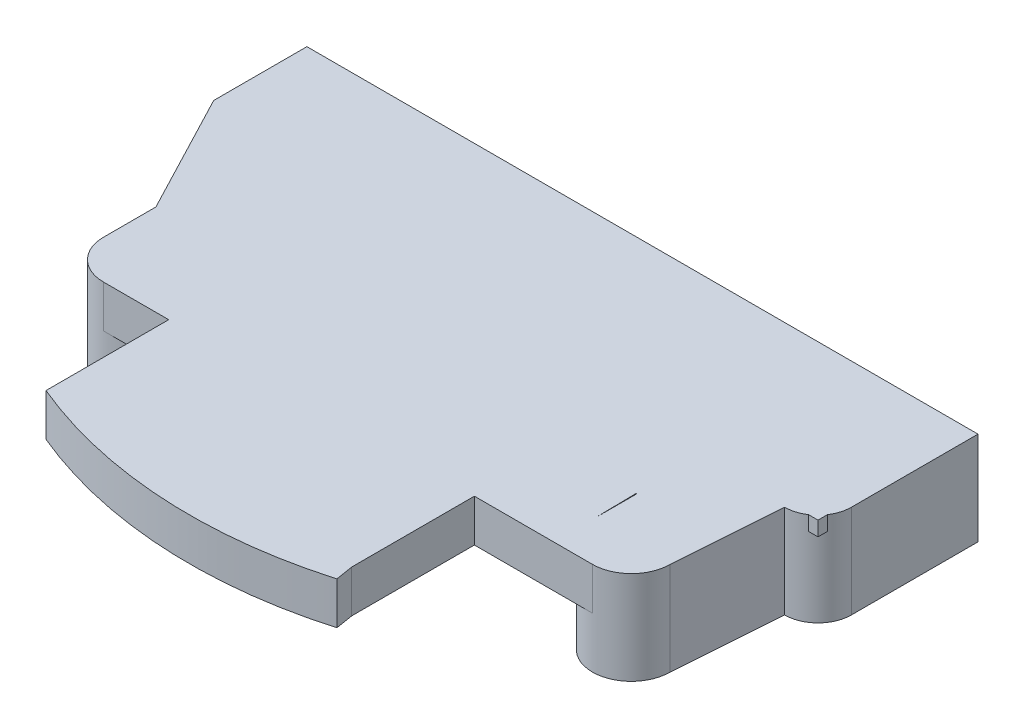
ISO-10303-21;
HEADER;
FILE_DESCRIPTION(('STEP AP214'),'2;1');
FILE_NAME('part.step','',(''),(''),'','','');
FILE_SCHEMA(('AUTOMOTIVE_DESIGN { 1 0 10303 214 1 1 1 1 }'));
ENDSEC;
DATA;
#1=APPLICATION_CONTEXT('core data for automotive mechanical design processes');
#2=APPLICATION_PROTOCOL_DEFINITION('international standard','automotive_design',2000,#1);
#3=PRODUCT_CONTEXT('',#1,'mechanical');
#4=PRODUCT('Part','Part','',(#3));
#5=PRODUCT_RELATED_PRODUCT_CATEGORY('part','',(#4));
#6=PRODUCT_DEFINITION_FORMATION('','',#4);
#7=PRODUCT_DEFINITION_CONTEXT('part definition',#1,'design');
#8=PRODUCT_DEFINITION('design','',#6,#7);
#9=PRODUCT_DEFINITION_SHAPE('','',#8);
#10=(LENGTH_UNIT() NAMED_UNIT(*) SI_UNIT(.MILLI.,.METRE.));
#11=(NAMED_UNIT(*) PLANE_ANGLE_UNIT() SI_UNIT($,.RADIAN.));
#12=(NAMED_UNIT(*) SI_UNIT($,.STERADIAN.) SOLID_ANGLE_UNIT());
#13=UNCERTAINTY_MEASURE_WITH_UNIT(LENGTH_MEASURE(1.E-05),#10,'distance_accuracy_value','');
#14=(GEOMETRIC_REPRESENTATION_CONTEXT(3) GLOBAL_UNCERTAINTY_ASSIGNED_CONTEXT((#13)) GLOBAL_UNIT_ASSIGNED_CONTEXT((#10,
#11,#12)) REPRESENTATION_CONTEXT('',''));
#15=CARTESIAN_POINT('',(0.,0.,0.));
#16=DIRECTION('',(0.,0.,1.));
#17=DIRECTION('',(1.,0.,0.));
#18=AXIS2_PLACEMENT_3D('',#15,#16,#17);
#19=CARTESIAN_POINT('',(-58.3130040874103,-46.5902974390858,26.1374810721039));
#20=DIRECTION('',(0.,1.,0.));
#21=DIRECTION('',(0.,0.,1.));
#22=AXIS2_PLACEMENT_3D('',#19,#20,#21);
#23=PLANE('',#22);
#24=CARTESIAN_POINT('',(36.5854661779904,-46.5902974390858,-15.2745439278961));
#25=DIRECTION('',(0.,1.,0.));
#26=DIRECTION('',(0.,0.,1.));
#27=AXIS2_PLACEMENT_3D('',#24,#25,#26);
#28=CIRCLE('',#27,3.81);
#29=CARTESIAN_POINT('',(36.5854661779904,-46.5902974390858,-11.4645439278961));
#30=VERTEX_POINT('',#29);
#31=CARTESIAN_POINT('',(40.3954661779904,-46.5902974390858,-15.2745439278961));
#32=VERTEX_POINT('',#31);
#33=EDGE_CURVE('E317',#30,#32,#28,.T.);
#34=ORIENTED_EDGE('',*,*,#33,.F.);
#35=DIRECTION('',(-0.0727235930973166,0.,0.997352133906082));
#36=VECTOR('',#35,1.);
#37=CARTESIAN_POINT('',(35.6964661779905,-46.5902974390858,0.727456072103921));
#38=LINE('',#37,#36);
#39=CARTESIAN_POINT('',(35.6964661779905,-46.5902974390858,0.727456072103921));
#40=VERTEX_POINT('',#39);
#41=EDGE_CURVE('E330',#30,#40,#38,.T.);
#42=ORIENTED_EDGE('',*,*,#41,.T.);
#43=CARTESIAN_POINT('',(31.2514661779905,-46.5902974390858,0.727456072103914));
#44=DIRECTION('',(0.,1.,0.));
#45=DIRECTION('',(0.,0.,1.));
#46=AXIS2_PLACEMENT_3D('',#43,#44,#45);
#47=CIRCLE('',#46,4.445);
#48=CARTESIAN_POINT('',(26.8064661779905,-46.5902974390858,0.727456072103914));
#49=VERTEX_POINT('',#48);
#50=EDGE_CURVE('E326',#40,#49,#47,.F.);
#51=ORIENTED_EDGE('',*,*,#50,.T.);
#52=DIRECTION('',(0.,0.,-1.));
#53=VECTOR('',#52,1.);
#54=CARTESIAN_POINT('',(26.8064661779905,-46.5902974390858,0.727456072103914));
#55=LINE('',#54,#53);
#56=CARTESIAN_POINT('',(26.8064661779905,-46.5902974390858,-29.7525439278961));
#57=VERTEX_POINT('',#56);
#58=EDGE_CURVE('E333',#49,#57,#55,.T.);
#59=ORIENTED_EDGE('',*,*,#58,.T.);
#60=DIRECTION('',(1.,0.,0.));
#61=VECTOR('',#60,1.);
#62=CARTESIAN_POINT('',(59.1914661779905,-46.5902974390858,-29.7525439278961));
#63=LINE('',#62,#61);
#64=CARTESIAN_POINT('',(40.3954661779904,-46.5902974390858,-29.7525439278961));
#65=VERTEX_POINT('',#64);
#66=EDGE_CURVE('E38',#57,#65,#63,.T.);
#67=ORIENTED_EDGE('',*,*,#66,.T.);
#68=DIRECTION('',(0.,0.,-1.));
#69=VECTOR('',#68,1.);
#70=CARTESIAN_POINT('',(40.3954661779904,-46.5902974390858,-117.503697606219));
#71=LINE('',#70,#69);
#72=EDGE_CURVE('E51',#32,#65,#71,.T.);
#73=ORIENTED_EDGE('',*,*,#72,.F.);
#74=EDGE_LOOP('',(#34,#42,#51,#59,#67,#73));
#75=FACE_BOUND('',#74,.T.);
#76=ADVANCED_FACE('F34',(#75),#23,.F.);
#77=CARTESIAN_POINT('',(40.3954661779904,-43.9359974390858,-117.503697606219));
#78=DIRECTION('',(-1.,0.,0.));
#79=DIRECTION('',(0.,0.,-1.));
#80=AXIS2_PLACEMENT_3D('',#77,#78,#79);
#81=PLANE('',#80);
#82=DIRECTION('',(0.,1.,0.));
#83=VECTOR('',#82,1.);
#84=CARTESIAN_POINT('',(40.3954661779904,-43.9359974390858,-29.7525439278961));
#85=LINE('',#84,#83);
#86=CARTESIAN_POINT('',(40.3954661779904,-35.9222974390858,-29.7525439278961));
#87=VERTEX_POINT('',#86);
#88=EDGE_CURVE('E312',#65,#87,#85,.T.);
#89=ORIENTED_EDGE('',*,*,#88,.T.);
#90=DIRECTION('',(0.,0.,-1.));
#91=VECTOR('',#90,1.);
#92=CARTESIAN_POINT('',(40.3954661779904,-35.9222974390858,-117.503697606219));
#93=LINE('',#92,#91);
#94=CARTESIAN_POINT('',(40.3954661779904,-35.9222974390858,-15.2745439278961));
#95=VERTEX_POINT('',#94);
#96=EDGE_CURVE('E262',#95,#87,#93,.T.);
#97=ORIENTED_EDGE('',*,*,#96,.F.);
#98=DIRECTION('',(0.,1.,0.));
#99=VECTOR('',#98,1.);
#100=CARTESIAN_POINT('',(40.3954661779904,-43.9359974390858,-15.2745439278961));
#101=LINE('',#100,#99);
#102=EDGE_CURVE('E316',#32,#95,#101,.T.);
#103=ORIENTED_EDGE('',*,*,#102,.F.);
#104=ORIENTED_EDGE('',*,*,#72,.T.);
#105=EDGE_LOOP('',(#89,#97,#103,#104));
#106=FACE_BOUND('',#105,.T.);
#107=ADVANCED_FACE('F485',(#106),#81,.F.);
#108=CARTESIAN_POINT('',(59.1914661779905,-43.9359974390858,-29.7525439278961));
#109=DIRECTION('',(0.,0.,-1.));
#110=DIRECTION('',(-1.,0.,0.));
#111=AXIS2_PLACEMENT_3D('',#108,#109,#110);
#112=PLANE('',#111);
#113=DIRECTION('',(0.,-1.,0.));
#114=VECTOR('',#113,1.);
#115=CARTESIAN_POINT('',(26.8064661779905,-40.7609974390858,-29.7525439278961));
#116=LINE('',#115,#114);
#117=CARTESIAN_POINT('',(26.8064661779905,-40.7609974390858,-29.7525439278961));
#118=VERTEX_POINT('',#117);
#119=EDGE_CURVE('E43',#118,#57,#116,.T.);
#120=ORIENTED_EDGE('',*,*,#119,.F.);
#121=DIRECTION('',(1.,0.,0.));
#122=VECTOR('',#121,1.);
#123=CARTESIAN_POINT('',(73.1614661779904,-40.7609974390858,-29.7525439278961));
#124=LINE('',#123,#122);
#125=CARTESIAN_POINT('',(-20.1835338220096,-40.7609974390858,-29.7525439278961));
#126=VERTEX_POINT('',#125);
#127=EDGE_CURVE('E216',#126,#118,#124,.T.);
#128=ORIENTED_EDGE('',*,*,#127,.F.);
#129=DIRECTION('',(0.,-1.,0.));
#130=VECTOR('',#129,1.);
#131=CARTESIAN_POINT('',(-20.1835338220096,-40.7609974390858,-29.7525439278961));
#132=LINE('',#131,#130);
#133=CARTESIAN_POINT('',(-20.1835338220096,-46.5902974390858,-29.7525439278961));
#134=VERTEX_POINT('',#133);
#135=EDGE_CURVE('E209',#126,#134,#132,.T.);
#136=ORIENTED_EDGE('',*,*,#135,.T.);
#137=DIRECTION('',(1.,0.,0.));
#138=VECTOR('',#137,1.);
#139=CARTESIAN_POINT('',(59.1914661779905,-46.5902974390858,-29.7525439278961));
#140=LINE('',#139,#138);
#141=CARTESIAN_POINT('',(-29.0735338220096,-46.5902974390858,-29.7525439278961));
#142=VERTEX_POINT('',#141);
#143=EDGE_CURVE('E214',#142,#134,#140,.T.);
#144=ORIENTED_EDGE('',*,*,#143,.F.);
#145=DIRECTION('',(0.,-1.,0.));
#146=VECTOR('',#145,1.);
#147=CARTESIAN_POINT('',(-29.0735338220096,-40.7609974390858,-29.7525439278961));
#148=LINE('',#147,#146);
#149=CARTESIAN_POINT('',(-29.0735338220096,-40.7609974390858,-29.7525439278961));
#150=VERTEX_POINT('',#149);
#151=EDGE_CURVE('E219',#150,#142,#148,.T.);
#152=ORIENTED_EDGE('',*,*,#151,.F.);
#153=CARTESIAN_POINT('',(-36.3125338220097,-40.7609974390858,-29.7525439278961));
#154=VERTEX_POINT('',#153);
#155=EDGE_CURVE('E435',#154,#150,#124,.T.);
#156=ORIENTED_EDGE('',*,*,#155,.F.);
#157=DIRECTION('',(0.,1.,0.));
#158=VECTOR('',#157,1.);
#159=CARTESIAN_POINT('',(-36.3125338220096,-45.2059974390858,-29.7525439278961));
#160=LINE('',#159,#158);
#161=CARTESIAN_POINT('',(-36.3125338220096,-35.9222974390858,-29.7525439278961));
#162=VERTEX_POINT('',#161);
#163=EDGE_CURVE('E289',#154,#162,#160,.T.);
#164=ORIENTED_EDGE('',*,*,#163,.T.);
#165=DIRECTION('',(1.,0.,0.));
#166=VECTOR('',#165,1.);
#167=CARTESIAN_POINT('',(59.1914661779905,-35.9222974390858,-29.7525439278961));
#168=LINE('',#167,#166);
#169=EDGE_CURVE('E259',#162,#87,#168,.T.);
#170=ORIENTED_EDGE('',*,*,#169,.T.);
#171=ORIENTED_EDGE('',*,*,#88,.F.);
#172=ORIENTED_EDGE('',*,*,#66,.F.);
#173=EDGE_LOOP('',(#120,#128,#136,#144,#152,#156,#164,#170,#171,#172));
#174=FACE_BOUND('',#173,.T.);
#175=ADVANCED_FACE('F211',(#174),#112,.T.);
#176=CARTESIAN_POINT('',(31.2514661779905,-40.7609974390858,0.727456072103914));
#177=DIRECTION('',(0.,1.,0.));
#178=DIRECTION('',(0.,0.,-1.));
#179=AXIS2_PLACEMENT_3D('',#176,#177,#178);
#180=CYLINDRICAL_SURFACE('',#179,4.445);
#181=DIRECTION('',(0.,1.,0.));
#182=VECTOR('',#181,1.);
#183=CARTESIAN_POINT('',(35.6964661779905,-40.7609974390858,0.727456072103921));
#184=LINE('',#183,#182);
#185=CARTESIAN_POINT('',(35.6964661779905,-35.9222974390858,0.727456072103921));
#186=VERTEX_POINT('',#185);
#187=EDGE_CURVE('E315',#40,#186,#184,.T.);
#188=ORIENTED_EDGE('',*,*,#187,.T.);
#189=CARTESIAN_POINT('',(31.2514661779905,-35.9222974390858,0.727456072103914));
#190=DIRECTION('',(0.,1.,0.));
#191=DIRECTION('',(0.,0.,1.));
#192=AXIS2_PLACEMENT_3D('',#189,#190,#191);
#193=CIRCLE('',#192,4.445);
#194=CARTESIAN_POINT('',(31.2514661779905,-35.9222974390858,5.17245607210391));
#195=VERTEX_POINT('',#194);
#196=EDGE_CURVE('E246',#186,#195,#193,.F.);
#197=ORIENTED_EDGE('',*,*,#196,.T.);
#198=DIRECTION('',(0.,-1.,0.));
#199=VECTOR('',#198,1.);
#200=CARTESIAN_POINT('',(31.2514661779905,-34.4109974390858,5.17245607210391));
#201=LINE('',#200,#199);
#202=CARTESIAN_POINT('',(31.2514661779905,-40.7609974390858,5.17245607210392));
#203=VERTEX_POINT('',#202);
#204=EDGE_CURVE('E358',#195,#203,#201,.T.);
#205=ORIENTED_EDGE('',*,*,#204,.T.);
#206=CARTESIAN_POINT('',(31.2514661779905,-40.7609974390858,0.727456072103914));
#207=DIRECTION('',(0.,-1.,0.));
#208=DIRECTION('',(1.,0.,0.));
#209=AXIS2_PLACEMENT_3D('',#206,#207,#208);
#210=CIRCLE('',#209,4.445);
#211=CARTESIAN_POINT('',(26.8064661779905,-40.7609974390858,0.727456072103914));
#212=VERTEX_POINT('',#211);
#213=EDGE_CURVE('E473',#203,#212,#210,.T.);
#214=ORIENTED_EDGE('',*,*,#213,.T.);
#215=DIRECTION('',(0.,-1.,0.));
#216=VECTOR('',#215,1.);
#217=CARTESIAN_POINT('',(26.8064661779905,-40.7609974390858,0.727456072103914));
#218=LINE('',#217,#216);
#219=EDGE_CURVE('E11',#212,#49,#218,.T.);
#220=ORIENTED_EDGE('',*,*,#219,.T.);
#221=ORIENTED_EDGE('',*,*,#50,.F.);
#222=EDGE_LOOP('',(#188,#197,#205,#214,#220,#221));
#223=FACE_BOUND('',#222,.T.);
#224=ADVANCED_FACE('F342',(#223),#180,.T.);
#225=CARTESIAN_POINT('',(26.8064661779905,-40.7609974390858,0.727456072103914));
#226=DIRECTION('',(-1.,0.,0.));
#227=DIRECTION('',(0.,-1.,0.));
#228=AXIS2_PLACEMENT_3D('',#225,#226,#227);
#229=PLANE('',#228);
#230=ORIENTED_EDGE('',*,*,#219,.F.);
#231=DIRECTION('',(0.,0.,-1.));
#232=VECTOR('',#231,1.);
#233=CARTESIAN_POINT('',(26.8064661779905,-40.7609974390858,0.727456072103914));
#234=LINE('',#233,#232);
#235=EDGE_CURVE('E474',#212,#118,#234,.T.);
#236=ORIENTED_EDGE('',*,*,#235,.T.);
#237=ORIENTED_EDGE('',*,*,#119,.T.);
#238=ORIENTED_EDGE('',*,*,#58,.F.);
#239=EDGE_LOOP('',(#230,#236,#237,#238));
#240=FACE_BOUND('',#239,.T.);
#241=ADVANCED_FACE('F483',(#240),#229,.T.);
#242=CARTESIAN_POINT('',(36.5854661779904,-43.9359974390858,-15.2745439278961));
#243=DIRECTION('',(0.,1.,0.));
#244=DIRECTION('',(0.,0.,-1.));
#245=AXIS2_PLACEMENT_3D('',#242,#243,#244);
#246=CYLINDRICAL_SURFACE('',#245,3.81);
#247=ORIENTED_EDGE('',*,*,#102,.T.);
#248=CARTESIAN_POINT('',(36.5854661779904,-35.9222974390858,-15.2745439278961));
#249=DIRECTION('',(0.,1.,0.));
#250=DIRECTION('',(0.,0.,1.));
#251=AXIS2_PLACEMENT_3D('',#248,#249,#250);
#252=CIRCLE('',#251,3.81);
#253=CARTESIAN_POINT('',(39.7604661779904,-35.9222974390858,-13.1684871860204));
#254=VERTEX_POINT('',#253);
#255=EDGE_CURVE('E298',#254,#95,#252,.T.);
#256=ORIENTED_EDGE('',*,*,#255,.F.);
#257=DIRECTION('',(0.,1.,0.));
#258=VECTOR('',#257,1.);
#259=CARTESIAN_POINT('',(39.7604661779904,-37.5859974390858,-13.1684871860204));
#260=LINE('',#259,#258);
#261=CARTESIAN_POINT('',(39.7604661779904,-37.5859974390858,-13.1684871860204));
#262=VERTEX_POINT('',#261);
#263=EDGE_CURVE('E407',#262,#254,#260,.T.);
#264=ORIENTED_EDGE('',*,*,#263,.F.);
#265=CARTESIAN_POINT('',(36.5854661779904,-37.5859974390858,-15.2745439278961));
#266=DIRECTION('',(0.,-1.,0.));
#267=DIRECTION('',(0.,0.,1.));
#268=AXIS2_PLACEMENT_3D('',#265,#266,#267);
#269=CIRCLE('',#268,3.81);
#270=CARTESIAN_POINT('',(38.6915229198661,-37.5859974390858,-12.0995439278961));
#271=VERTEX_POINT('',#270);
#272=EDGE_CURVE('E278',#262,#271,#269,.T.);
#273=ORIENTED_EDGE('',*,*,#272,.T.);
#274=DIRECTION('',(0.,1.,0.));
#275=VECTOR('',#274,1.);
#276=CARTESIAN_POINT('',(38.6915229198661,-37.5859974390858,-12.0995439278961));
#277=LINE('',#276,#275);
#278=CARTESIAN_POINT('',(38.6915229198661,-35.9222974390858,-12.0995439278961));
#279=VERTEX_POINT('',#278);
#280=EDGE_CURVE('E275',#279,#271,#277,.F.);
#281=ORIENTED_EDGE('',*,*,#280,.F.);
#282=CARTESIAN_POINT('',(36.5854661779904,-35.9222974390858,-11.4645439278961));
#283=VERTEX_POINT('',#282);
#284=EDGE_CURVE('E297',#283,#279,#252,.T.);
#285=ORIENTED_EDGE('',*,*,#284,.F.);
#286=DIRECTION('',(0.,-1.,0.));
#287=VECTOR('',#286,1.);
#288=CARTESIAN_POINT('',(36.5854661779904,-34.4109974390858,-11.4645439278961));
#289=LINE('',#288,#287);
#290=EDGE_CURVE('E338',#283,#30,#289,.T.);
#291=ORIENTED_EDGE('',*,*,#290,.T.);
#292=ORIENTED_EDGE('',*,*,#33,.T.);
#293=EDGE_LOOP('',(#247,#256,#264,#273,#281,#285,#291,#292));
#294=FACE_BOUND('',#293,.T.);
#295=ADVANCED_FACE('F493',(#294),#246,.T.);
#296=CARTESIAN_POINT('',(35.6964661779905,-34.4109974390858,0.727456072103921));
#297=DIRECTION('',(0.997352133906082,0.,0.0727235930973167));
#298=DIRECTION('',(0.0727235930973166,0.,-0.997352133906082));
#299=AXIS2_PLACEMENT_3D('',#296,#297,#298);
#300=PLANE('',#299);
#301=ORIENTED_EDGE('',*,*,#290,.F.);
#302=DIRECTION('',(-0.0727235930973166,0.,0.997352133906082));
#303=VECTOR('',#302,1.);
#304=CARTESIAN_POINT('',(35.6964661779905,-35.9222974390858,0.727456072103921));
#305=LINE('',#304,#303);
#306=EDGE_CURVE('E266',#283,#186,#305,.T.);
#307=ORIENTED_EDGE('',*,*,#306,.T.);
#308=ORIENTED_EDGE('',*,*,#187,.F.);
#309=ORIENTED_EDGE('',*,*,#41,.F.);
#310=EDGE_LOOP('',(#301,#307,#308,#309));
#311=FACE_BOUND('',#310,.T.);
#312=ADVANCED_FACE('F36',(#311),#300,.T.);
#313=CARTESIAN_POINT('',(-58.3130040874102,-35.9222974390858,26.1374810721039));
#314=DIRECTION('',(0.,1.,0.));
#315=DIRECTION('',(0.,0.,1.));
#316=AXIS2_PLACEMENT_3D('',#313,#314,#315);
#317=PLANE('',#316);
#318=DIRECTION('',(0.0157009408410438,0.,0.999876732630931));
#319=VECTOR('',#318,1.);
#320=CARTESIAN_POINT('',(26.7269887675431,-35.9222974390858,-4.33387205342697));
#321=LINE('',#320,#319);
#322=CARTESIAN_POINT('',(26.7269887675431,-35.9222974390858,-4.33387205342697));
#323=VERTEX_POINT('',#322);
#324=CARTESIAN_POINT('',(26.8064661779905,-35.9222974390858,0.727456072103928));
#325=VERTEX_POINT('',#324);
#326=EDGE_CURVE('E271',#323,#325,#321,.T.);
#327=ORIENTED_EDGE('',*,*,#326,.F.);
#328=DIRECTION('',(-1.,0.,0.));
#329=VECTOR('',#328,1.);
#330=CARTESIAN_POINT('',(35.6964661779905,-35.9222974390858,-4.33387205342697));
#331=LINE('',#330,#329);
#332=CARTESIAN_POINT('',(26.8064661779905,-35.9222974390858,-4.33387205342697));
#333=VERTEX_POINT('',#332);
#334=EDGE_CURVE('E274',#333,#323,#331,.T.);
#335=ORIENTED_EDGE('',*,*,#334,.F.);
#336=DIRECTION('',(0.,0.,1.));
#337=VECTOR('',#336,1.);
#338=CARTESIAN_POINT('',(26.8064661779904,-35.9222974390858,-117.503697606219));
#339=LINE('',#338,#337);
#340=EDGE_CURVE('E235',#333,#325,#339,.T.);
#341=ORIENTED_EDGE('',*,*,#340,.T.);
#342=EDGE_LOOP('',(#327,#335,#341));
#343=FACE_BOUND('',#342,.T.);
#344=DIRECTION('',(0.,0.,-1.));
#345=VECTOR('',#344,1.);
#346=CARTESIAN_POINT('',(-29.0735338220096,-35.9222974390858,-4.33387205342696));
#347=LINE('',#346,#345);
#348=CARTESIAN_POINT('',(-29.0735338220096,-35.9222974390858,0.727456072103921));
#349=VERTEX_POINT('',#348);
#350=CARTESIAN_POINT('',(-29.0735338220096,-35.9222974390858,-5.25209377555619));
#351=VERTEX_POINT('',#350);
#352=EDGE_CURVE('E243',#349,#351,#347,.T.);
#353=ORIENTED_EDGE('',*,*,#352,.F.);
#354=CARTESIAN_POINT('',(-24.6285338220096,-35.9222974390858,0.727456072103928));
#355=DIRECTION('',(0.,1.,0.));
#356=DIRECTION('',(0.,0.,1.));
#357=AXIS2_PLACEMENT_3D('',#354,#355,#356);
#358=CIRCLE('',#357,4.445);
#359=CARTESIAN_POINT('',(-24.6285338220096,-35.9222974390858,5.17245607210393));
#360=VERTEX_POINT('',#359);
#361=EDGE_CURVE('E245',#360,#349,#358,.F.);
#362=ORIENTED_EDGE('',*,*,#361,.F.);
#363=DIRECTION('',(-1.,0.,0.));
#364=VECTOR('',#363,1.);
#365=CARTESIAN_POINT('',(-24.6285338220096,-35.9222974390858,5.17245607210393));
#366=LINE('',#365,#364);
#367=CARTESIAN_POINT('',(-17.183465881078,-35.9222974390858,5.17245607210392));
#368=VERTEX_POINT('',#367);
#369=EDGE_CURVE('E249',#368,#360,#366,.T.);
#370=ORIENTED_EDGE('',*,*,#369,.F.);
#371=DIRECTION('',(0.,0.,-1.));
#372=VECTOR('',#371,1.);
#373=CARTESIAN_POINT('',(-17.183465881078,-35.9222974390858,19.1972413404618));
#374=LINE('',#373,#372);
#375=CARTESIAN_POINT('',(-17.183465881078,-35.9222974390858,19.1972413404618));
#376=VERTEX_POINT('',#375);
#377=EDGE_CURVE('E248',#376,#368,#374,.T.);
#378=ORIENTED_EDGE('',*,*,#377,.F.);
#379=CARTESIAN_POINT('',(3.31146617799043,-35.9222974390858,-29.7525439278961));
#380=DIRECTION('',(0.,1.,0.));
#381=DIRECTION('',(0.,0.,1.));
#382=AXIS2_PLACEMENT_3D('',#379,#380,#381);
#383=CIRCLE('',#382,53.0671623315603);
#384=CARTESIAN_POINT('',(18.0900408217472,-35.9222974390858,21.2152640436371));
#385=VERTEX_POINT('',#384);
#386=EDGE_CURVE('E256',#385,#376,#383,.F.);
#387=ORIENTED_EDGE('',*,*,#386,.F.);
#388=DIRECTION('',(0.162587309122813,0.,0.986694160777392));
#389=VECTOR('',#388,1.);
#390=CARTESIAN_POINT('',(17.7575113570958,-35.9222974390858,19.1972413404617));
#391=LINE('',#390,#389);
#392=CARTESIAN_POINT('',(17.7575113570958,-35.9222974390858,19.1972413404617));
#393=VERTEX_POINT('',#392);
#394=EDGE_CURVE('E252',#393,#385,#391,.T.);
#395=ORIENTED_EDGE('',*,*,#394,.F.);
#396=DIRECTION('',(0.,0.,1.));
#397=VECTOR('',#396,1.);
#398=CARTESIAN_POINT('',(17.7575113570957,-35.9222974390858,-4.33387205342697));
#399=LINE('',#398,#397);
#400=CARTESIAN_POINT('',(17.7575113570958,-35.9222974390858,5.17245607210392));
#401=VERTEX_POINT('',#400);
#402=EDGE_CURVE('E255',#401,#393,#399,.T.);
#403=ORIENTED_EDGE('',*,*,#402,.F.);
#404=DIRECTION('',(-1.,0.,0.));
#405=VECTOR('',#404,1.);
#406=CARTESIAN_POINT('',(31.2514661779905,-35.9222974390858,5.17245607210392));
#407=LINE('',#406,#405);
#408=EDGE_CURVE('E251',#195,#401,#407,.T.);
#409=ORIENTED_EDGE('',*,*,#408,.F.);
#410=ORIENTED_EDGE('',*,*,#196,.F.);
#411=ORIENTED_EDGE('',*,*,#306,.F.);
#412=ORIENTED_EDGE('',*,*,#284,.T.);
#413=DIRECTION('',(1.,0.,0.));
#414=VECTOR('',#413,1.);
#415=CARTESIAN_POINT('',(39.7604661779904,-35.9222974390858,-12.0995439278961));
#416=LINE('',#415,#414);
#417=CARTESIAN_POINT('',(39.7604661779904,-35.9222974390858,-12.0995439278961));
#418=VERTEX_POINT('',#417);
#419=EDGE_CURVE('E238',#279,#418,#416,.T.);
#420=ORIENTED_EDGE('',*,*,#419,.T.);
#421=DIRECTION('',(0.,0.,-1.));
#422=VECTOR('',#421,1.);
#423=CARTESIAN_POINT('',(39.7604661779904,-35.9222974390858,-12.0995439278961));
#424=LINE('',#423,#422);
#425=EDGE_CURVE('E307',#418,#254,#424,.T.);
#426=ORIENTED_EDGE('',*,*,#425,.T.);
#427=ORIENTED_EDGE('',*,*,#255,.T.);
#428=ORIENTED_EDGE('',*,*,#96,.T.);
#429=ORIENTED_EDGE('',*,*,#169,.F.);
#430=DIRECTION('',(0.,0.,1.));
#431=VECTOR('',#430,1.);
#432=CARTESIAN_POINT('',(-36.3125338220096,-35.9222974390858,-44.8816155146868));
#433=LINE('',#432,#431);
#434=CARTESIAN_POINT('',(-36.3125338220096,-35.9222974390858,-19.1006155146868));
#435=VERTEX_POINT('',#434);
#436=EDGE_CURVE('E304',#162,#435,#433,.T.);
#437=ORIENTED_EDGE('',*,*,#436,.T.);
#438=DIRECTION('',(0.463254209343684,0.,0.886225443961839));
#439=VECTOR('',#438,1.);
#440=CARTESIAN_POINT('',(-36.3125338220096,-35.9222974390858,-19.1006155146868));
#441=LINE('',#440,#439);
#442=EDGE_CURVE('E301',#435,#351,#441,.T.);
#443=ORIENTED_EDGE('',*,*,#442,.T.);
#444=EDGE_LOOP('',(#353,#362,#370,#378,#387,#395,#403,#409,#410,#411,#412,#420,#426,#427,#428,
#429,#437,#443));
#445=FACE_BOUND('',#444,.T.);
#446=ADVANCED_FACE('F350',(#343,#445),#317,.T.);
#447=CARTESIAN_POINT('',(-70.9494457008639,-37.5859974390858,-29.7625439278961));
#448=DIRECTION('',(0.,-1.,0.));
#449=DIRECTION('',(0.,0.,1.));
#450=AXIS2_PLACEMENT_3D('',#447,#448,#449);
#451=PLANE('',#450);
#452=DIRECTION('',(0.0157009408410427,0.,0.999876732630931));
#453=VECTOR('',#452,1.);
#454=CARTESIAN_POINT('',(26.8064661779905,-37.5859974390858,0.727456072103921));
#455=LINE('',#454,#453);
#456=CARTESIAN_POINT('',(26.7269887675431,-37.5859974390858,-4.33387205342696));
#457=VERTEX_POINT('',#456);
#458=CARTESIAN_POINT('',(26.8064661779905,-37.5859974390858,0.727456072103928));
#459=VERTEX_POINT('',#458);
#460=EDGE_CURVE('E401',#457,#459,#455,.T.);
#461=ORIENTED_EDGE('',*,*,#460,.T.);
#462=DIRECTION('',(0.,0.,-1.));
#463=VECTOR('',#462,1.);
#464=CARTESIAN_POINT('',(26.8064661779904,-37.5859974390858,-117.503697606219));
#465=LINE('',#464,#463);
#466=CARTESIAN_POINT('',(26.8064661779905,-37.5859974390858,-4.33387205342697));
#467=VERTEX_POINT('',#466);
#468=EDGE_CURVE('E376',#459,#467,#465,.T.);
#469=ORIENTED_EDGE('',*,*,#468,.T.);
#470=DIRECTION('',(1.,0.,0.));
#471=VECTOR('',#470,1.);
#472=CARTESIAN_POINT('',(3.31146617799043,-37.5859974390858,-4.33387205342696));
#473=LINE('',#472,#471);
#474=EDGE_CURVE('E403',#457,#467,#473,.T.);
#475=ORIENTED_EDGE('',*,*,#474,.F.);
#476=EDGE_LOOP('',(#461,#469,#475));
#477=FACE_BOUND('',#476,.T.);
#478=ADVANCED_FACE('F498',(#477),#451,.F.);
#479=CARTESIAN_POINT('',(26.7269887675431,-34.4109974390858,-4.33387205342697));
#480=DIRECTION('',(0.999876732630931,0.,-0.0157009408410438));
#481=DIRECTION('',(-0.0157009408410438,0.,-0.999876732630931));
#482=AXIS2_PLACEMENT_3D('',#479,#480,#481);
#483=PLANE('',#482);
#484=DIRECTION('',(0.,-1.,0.));
#485=VECTOR('',#484,1.);
#486=CARTESIAN_POINT('',(26.7269887675431,-34.4109974390858,-4.33387205342697));
#487=LINE('',#486,#485);
#488=EDGE_CURVE('E363',#323,#457,#487,.T.);
#489=ORIENTED_EDGE('',*,*,#488,.F.);
#490=ORIENTED_EDGE('',*,*,#326,.T.);
#491=DIRECTION('',(0.,1.,0.));
#492=VECTOR('',#491,1.);
#493=CARTESIAN_POINT('',(26.8064661779905,-37.5859974390858,0.727456072103928));
#494=LINE('',#493,#492);
#495=EDGE_CURVE('E279',#459,#325,#494,.T.);
#496=ORIENTED_EDGE('',*,*,#495,.F.);
#497=ORIENTED_EDGE('',*,*,#460,.F.);
#498=EDGE_LOOP('',(#489,#490,#496,#497));
#499=FACE_BOUND('',#498,.T.);
#500=ADVANCED_FACE('F557',(#499),#483,.T.);
#501=CARTESIAN_POINT('',(26.8064661779904,-37.5859974390858,-117.503697606219));
#502=DIRECTION('',(1.,0.,0.));
#503=DIRECTION('',(0.,0.,1.));
#504=AXIS2_PLACEMENT_3D('',#501,#502,#503);
#505=PLANE('',#504);
#506=ORIENTED_EDGE('',*,*,#340,.F.);
#507=DIRECTION('',(0.,1.,0.));
#508=VECTOR('',#507,1.);
#509=CARTESIAN_POINT('',(26.8064661779905,-37.5859974390858,-4.33387205342697));
#510=LINE('',#509,#508);
#511=EDGE_CURVE('E406',#467,#333,#510,.T.);
#512=ORIENTED_EDGE('',*,*,#511,.F.);
#513=ORIENTED_EDGE('',*,*,#468,.F.);
#514=ORIENTED_EDGE('',*,*,#495,.T.);
#515=EDGE_LOOP('',(#506,#512,#513,#514));
#516=FACE_BOUND('',#515,.T.);
#517=ADVANCED_FACE('F567',(#516),#505,.F.);
#518=CARTESIAN_POINT('',(35.6964661779905,-40.7609974390858,-4.33387205342697));
#519=DIRECTION('',(0.,0.,1.));
#520=DIRECTION('',(-1.,0.,0.));
#521=AXIS2_PLACEMENT_3D('',#518,#519,#520);
#522=PLANE('',#521);
#523=ORIENTED_EDGE('',*,*,#511,.T.);
#524=ORIENTED_EDGE('',*,*,#334,.T.);
#525=ORIENTED_EDGE('',*,*,#488,.T.);
#526=ORIENTED_EDGE('',*,*,#474,.T.);
#527=EDGE_LOOP('',(#523,#524,#525,#526));
#528=FACE_BOUND('',#527,.T.);
#529=ADVANCED_FACE('F577',(#528),#522,.T.);
#530=CARTESIAN_POINT('',(-29.0735338220096,-40.7609974390858,-4.33387205342696));
#531=DIRECTION('',(-1.,0.,0.));
#532=DIRECTION('',(0.,0.,-1.));
#533=AXIS2_PLACEMENT_3D('',#530,#531,#532);
#534=PLANE('',#533);
#535=DIRECTION('',(0.,1.,0.));
#536=VECTOR('',#535,1.);
#537=CARTESIAN_POINT('',(-29.0735338220096,-40.7609974390858,0.727456072103921));
#538=LINE('',#537,#536);
#539=CARTESIAN_POINT('',(-29.0735338220096,-46.5902974390858,0.727456072103921));
#540=VERTEX_POINT('',#539);
#541=EDGE_CURVE('E290',#540,#349,#538,.T.);
#542=ORIENTED_EDGE('',*,*,#541,.T.);
#543=ORIENTED_EDGE('',*,*,#352,.T.);
#544=DIRECTION('',(0.,-1.,0.));
#545=VECTOR('',#544,1.);
#546=CARTESIAN_POINT('',(-29.0735338220096,-34.4109974390858,-5.25209377555619));
#547=LINE('',#546,#545);
#548=CARTESIAN_POINT('',(-29.0735338220095,-40.7609974390858,-5.25209377555608));
#549=VERTEX_POINT('',#548);
#550=EDGE_CURVE('E456',#351,#549,#547,.T.);
#551=ORIENTED_EDGE('',*,*,#550,.T.);
#552=DIRECTION('',(0.,0.,-1.));
#553=VECTOR('',#552,1.);
#554=CARTESIAN_POINT('',(-29.0735338220096,-40.7609974390858,0.727456072103921));
#555=LINE('',#554,#553);
#556=EDGE_CURVE('E463',#549,#150,#555,.T.);
#557=ORIENTED_EDGE('',*,*,#556,.T.);
#558=ORIENTED_EDGE('',*,*,#151,.T.);
#559=DIRECTION('',(0.,0.,-1.));
#560=VECTOR('',#559,1.);
#561=CARTESIAN_POINT('',(-29.0735338220096,-46.5902974390858,-4.33387205342696));
#562=LINE('',#561,#560);
#563=EDGE_CURVE('E234',#540,#142,#562,.T.);
#564=ORIENTED_EDGE('',*,*,#563,.F.);
#565=EDGE_LOOP('',(#542,#543,#551,#557,#558,#564));
#566=FACE_BOUND('',#565,.T.);
#567=ADVANCED_FACE('F587',(#566),#534,.T.);
#568=CARTESIAN_POINT('',(-36.3125338220096,-39.8719974390858,-19.1006155146868));
#569=DIRECTION('',(0.886225443961839,0.,-0.463254209343684));
#570=DIRECTION('',(0.463254209343684,0.,0.886225443961839));
#571=AXIS2_PLACEMENT_3D('',#568,#569,#570);
#572=PLANE('',#571);
#573=ORIENTED_EDGE('',*,*,#442,.F.);
#574=DIRECTION('',(0.,1.,0.));
#575=VECTOR('',#574,1.);
#576=CARTESIAN_POINT('',(-36.3125338220096,-39.8719974390858,-19.1006155146868));
#577=LINE('',#576,#575);
#578=CARTESIAN_POINT('',(-36.3125338220096,-40.7609974390858,-19.1006155146868));
#579=VERTEX_POINT('',#578);
#580=EDGE_CURVE('E424',#579,#435,#577,.T.);
#581=ORIENTED_EDGE('',*,*,#580,.F.);
#582=DIRECTION('',(0.463254209343684,0.,0.886225443961839));
#583=VECTOR('',#582,1.);
#584=CARTESIAN_POINT('',(-36.3125338220096,-40.7609974390858,-19.1006155146868));
#585=LINE('',#584,#583);
#586=EDGE_CURVE('E429',#579,#549,#585,.T.);
#587=ORIENTED_EDGE('',*,*,#586,.T.);
#588=ORIENTED_EDGE('',*,*,#550,.F.);
#589=EDGE_LOOP('',(#573,#581,#587,#588));
#590=FACE_BOUND('',#589,.T.);
#591=ADVANCED_FACE('F455',(#590),#572,.F.);
#592=CARTESIAN_POINT('',(-70.9494457008639,-40.7609974390858,-29.7625439278961));
#593=DIRECTION('',(0.,-1.,0.));
#594=DIRECTION('',(0.,0.,1.));
#595=AXIS2_PLACEMENT_3D('',#592,#593,#594);
#596=PLANE('',#595);
#597=ORIENTED_EDGE('',*,*,#556,.F.);
#598=ORIENTED_EDGE('',*,*,#586,.F.);
#599=DIRECTION('',(0.,0.,1.));
#600=VECTOR('',#599,1.);
#601=CARTESIAN_POINT('',(-36.3125338220096,-40.7609974390858,-29.7525439278961));
#602=LINE('',#601,#600);
#603=EDGE_CURVE('E426',#154,#579,#602,.T.);
#604=ORIENTED_EDGE('',*,*,#603,.F.);
#605=ORIENTED_EDGE('',*,*,#155,.T.);
#606=EDGE_LOOP('',(#597,#598,#604,#605));
#607=FACE_BOUND('',#606,.T.);
#608=ADVANCED_FACE('F460',(#607),#596,.T.);
#609=CARTESIAN_POINT('',(3.31146617799043,-34.4109974390858,-29.7525439278961));
#610=DIRECTION('',(0.,-1.,0.));
#611=DIRECTION('',(0.,0.,-1.));
#612=AXIS2_PLACEMENT_3D('',#609,#610,#611);
#613=CYLINDRICAL_SURFACE('',#612,53.0671623315603);
#614=DIRECTION('',(0.,-1.,0.));
#615=VECTOR('',#614,1.);
#616=CARTESIAN_POINT('',(18.0900408217472,-34.4109974390858,21.2152640436371));
#617=LINE('',#616,#615);
#618=CARTESIAN_POINT('',(18.0900408217472,-40.7609974390858,21.2152640436371));
#619=VERTEX_POINT('',#618);
#620=EDGE_CURVE('E286',#385,#619,#617,.T.);
#621=ORIENTED_EDGE('',*,*,#620,.F.);
#622=ORIENTED_EDGE('',*,*,#386,.T.);
#623=DIRECTION('',(0.,1.,0.));
#624=VECTOR('',#623,1.);
#625=CARTESIAN_POINT('',(-17.183465881078,-40.7609974390858,19.1972413404618));
#626=LINE('',#625,#624);
#627=CARTESIAN_POINT('',(-17.183465881078,-40.7609974390858,19.1972413404618));
#628=VERTEX_POINT('',#627);
#629=EDGE_CURVE('E294',#628,#376,#626,.T.);
#630=ORIENTED_EDGE('',*,*,#629,.F.);
#631=CARTESIAN_POINT('',(3.31146617799043,-40.7609974390858,-29.7525439278961));
#632=DIRECTION('',(0.,-1.,0.));
#633=DIRECTION('',(0.,0.,1.));
#634=AXIS2_PLACEMENT_3D('',#631,#632,#633);
#635=CIRCLE('',#634,53.0671623315603);
#636=EDGE_CURVE('E288',#619,#628,#635,.T.);
#637=ORIENTED_EDGE('',*,*,#636,.F.);
#638=EDGE_LOOP('',(#621,#622,#630,#637));
#639=FACE_BOUND('',#638,.T.);
#640=ADVANCED_FACE('F619',(#639),#613,.T.);
#641=CARTESIAN_POINT('',(39.7604661779904,-35.8079974390858,-12.0995439278961));
#642=DIRECTION('',(-1.,0.,0.));
#643=DIRECTION('',(0.,0.,-1.));
#644=AXIS2_PLACEMENT_3D('',#641,#642,#643);
#645=PLANE('',#644);
#646=ORIENTED_EDGE('',*,*,#425,.F.);
#647=DIRECTION('',(0.,1.,0.));
#648=VECTOR('',#647,1.);
#649=CARTESIAN_POINT('',(39.7604661779904,-35.8079974390858,-12.0995439278961));
#650=LINE('',#649,#648);
#651=CARTESIAN_POINT('',(39.7604661779904,-37.5859974390858,-12.0995439278961));
#652=VERTEX_POINT('',#651);
#653=EDGE_CURVE('E387',#652,#418,#650,.T.);
#654=ORIENTED_EDGE('',*,*,#653,.F.);
#655=DIRECTION('',(0.,0.,-1.));
#656=VECTOR('',#655,1.);
#657=CARTESIAN_POINT('',(39.7604661779904,-37.5859974390858,-12.0995439278961));
#658=LINE('',#657,#656);
#659=EDGE_CURVE('E394',#652,#262,#658,.T.);
#660=ORIENTED_EDGE('',*,*,#659,.T.);
#661=ORIENTED_EDGE('',*,*,#263,.T.);
#662=EDGE_LOOP('',(#646,#654,#660,#661));
#663=FACE_BOUND('',#662,.T.);
#664=ADVANCED_FACE('F643',(#663),#645,.F.);
#665=CARTESIAN_POINT('',(-70.9494457008639,-37.5859974390858,-29.7625439278961));
#666=DIRECTION('',(0.,-1.,0.));
#667=DIRECTION('',(0.,0.,1.));
#668=AXIS2_PLACEMENT_3D('',#665,#666,#667);
#669=PLANE('',#668);
#670=ORIENTED_EDGE('',*,*,#272,.F.);
#671=ORIENTED_EDGE('',*,*,#659,.F.);
#672=DIRECTION('',(1.,0.,0.));
#673=VECTOR('',#672,1.);
#674=CARTESIAN_POINT('',(33.9184661779904,-37.5859974390858,-12.0995439278961));
#675=LINE('',#674,#673);
#676=EDGE_CURVE('E381',#271,#652,#675,.T.);
#677=ORIENTED_EDGE('',*,*,#676,.F.);
#678=EDGE_LOOP('',(#670,#671,#677));
#679=FACE_BOUND('',#678,.T.);
#680=ADVANCED_FACE('F653',(#679),#669,.T.);
#681=CARTESIAN_POINT('',(17.7575113570957,-40.7609974390858,-4.33387205342697));
#682=DIRECTION('',(1.,0.,0.));
#683=DIRECTION('',(0.,0.,1.));
#684=AXIS2_PLACEMENT_3D('',#681,#682,#683);
#685=PLANE('',#684);
#686=DIRECTION('',(0.,-1.,0.));
#687=VECTOR('',#686,1.);
#688=CARTESIAN_POINT('',(17.7575113570958,-34.4109974390858,5.17245607210392));
#689=LINE('',#688,#687);
#690=CARTESIAN_POINT('',(17.7575113570958,-40.7609974390858,5.17245607210392));
#691=VERTEX_POINT('',#690);
#692=EDGE_CURVE('E356',#401,#691,#689,.T.);
#693=ORIENTED_EDGE('',*,*,#692,.F.);
#694=ORIENTED_EDGE('',*,*,#402,.T.);
#695=DIRECTION('',(0.,1.,0.));
#696=VECTOR('',#695,1.);
#697=CARTESIAN_POINT('',(17.7575113570958,-40.7609974390858,19.1972413404617));
#698=LINE('',#697,#696);
#699=CARTESIAN_POINT('',(17.7575113570958,-40.7609974390858,19.1972413404617));
#700=VERTEX_POINT('',#699);
#701=EDGE_CURVE('E293',#700,#393,#698,.T.);
#702=ORIENTED_EDGE('',*,*,#701,.F.);
#703=DIRECTION('',(0.,0.,-1.));
#704=VECTOR('',#703,1.);
#705=CARTESIAN_POINT('',(17.7575113570957,-40.7609974390858,-4.33387205342697));
#706=LINE('',#705,#704);
#707=EDGE_CURVE('E446',#700,#691,#706,.T.);
#708=ORIENTED_EDGE('',*,*,#707,.T.);
#709=EDGE_LOOP('',(#693,#694,#702,#708));
#710=FACE_BOUND('',#709,.T.);
#711=ADVANCED_FACE('F663',(#710),#685,.T.);
#712=CARTESIAN_POINT('',(-24.6285338220096,-40.7609974390858,0.727456072103928));
#713=DIRECTION('',(0.,1.,0.));
#714=DIRECTION('',(0.,0.,-1.));
#715=AXIS2_PLACEMENT_3D('',#712,#713,#714);
#716=CYLINDRICAL_SURFACE('',#715,4.445);
#717=DIRECTION('',(0.,-1.,0.));
#718=VECTOR('',#717,1.);
#719=CARTESIAN_POINT('',(-24.6285338220096,-34.4109974390858,5.17245607210393));
#720=LINE('',#719,#718);
#721=CARTESIAN_POINT('',(-24.6285338220096,-40.7609974390858,5.17245607210393));
#722=VERTEX_POINT('',#721);
#723=EDGE_CURVE('E284',#360,#722,#720,.T.);
#724=ORIENTED_EDGE('',*,*,#723,.F.);
#725=ORIENTED_EDGE('',*,*,#361,.T.);
#726=ORIENTED_EDGE('',*,*,#541,.F.);
#727=CARTESIAN_POINT('',(-24.6285338220096,-46.5902974390858,0.727456072103928));
#728=DIRECTION('',(0.,1.,0.));
#729=DIRECTION('',(0.,0.,1.));
#730=AXIS2_PLACEMENT_3D('',#727,#728,#729);
#731=CIRCLE('',#730,4.445);
#732=CARTESIAN_POINT('',(-20.1835338220096,-46.5902974390858,0.727456072103921));
#733=VERTEX_POINT('',#732);
#734=EDGE_CURVE('E229',#733,#540,#731,.F.);
#735=ORIENTED_EDGE('',*,*,#734,.F.);
#736=DIRECTION('',(0.,-1.,0.));
#737=VECTOR('',#736,1.);
#738=CARTESIAN_POINT('',(-20.1835338220096,-40.7609974390858,0.727456072103921));
#739=LINE('',#738,#737);
#740=CARTESIAN_POINT('',(-20.1835338220096,-40.7609974390858,0.727456072103921));
#741=VERTEX_POINT('',#740);
#742=EDGE_CURVE('E220',#741,#733,#739,.T.);
#743=ORIENTED_EDGE('',*,*,#742,.F.);
#744=CARTESIAN_POINT('',(-24.6285338220096,-40.7609974390858,0.727456072103928));
#745=DIRECTION('',(0.,-1.,0.));
#746=DIRECTION('',(-1.,0.,0.));
#747=AXIS2_PLACEMENT_3D('',#744,#745,#746);
#748=CIRCLE('',#747,4.445);
#749=EDGE_CURVE('E335',#741,#722,#748,.T.);
#750=ORIENTED_EDGE('',*,*,#749,.T.);
#751=EDGE_LOOP('',(#724,#725,#726,#735,#743,#750));
#752=FACE_BOUND('',#751,.T.);
#753=ADVANCED_FACE('F673',(#752),#716,.T.);
#754=DIRECTION('',(0.,0.,1.));
#755=VECTOR('',#754,1.);
#756=CARTESIAN_POINT('',(-20.1835338220096,-40.7609974390858,-29.7525439278961));
#757=LINE('',#756,#755);
#758=EDGE_CURVE('E465',#126,#741,#757,.T.);
#759=ORIENTED_EDGE('',*,*,#758,.F.);
#760=ORIENTED_EDGE('',*,*,#127,.T.);
#761=ORIENTED_EDGE('',*,*,#235,.F.);
#762=ORIENTED_EDGE('',*,*,#213,.F.);
#763=DIRECTION('',(-1.,0.,0.));
#764=VECTOR('',#763,1.);
#765=CARTESIAN_POINT('',(31.2514661779905,-40.7609974390858,5.17245607210392));
#766=LINE('',#765,#764);
#767=EDGE_CURVE('E360',#203,#691,#766,.T.);
#768=ORIENTED_EDGE('',*,*,#767,.T.);
#769=ORIENTED_EDGE('',*,*,#707,.F.);
#770=DIRECTION('',(0.162587309122813,0.,0.986694160777392));
#771=VECTOR('',#770,1.);
#772=CARTESIAN_POINT('',(17.7575113570958,-40.7609974390858,19.1972413404617));
#773=LINE('',#772,#771);
#774=EDGE_CURVE('E419',#700,#619,#773,.T.);
#775=ORIENTED_EDGE('',*,*,#774,.T.);
#776=ORIENTED_EDGE('',*,*,#636,.T.);
#777=DIRECTION('',(0.,0.,1.));
#778=VECTOR('',#777,1.);
#779=CARTESIAN_POINT('',(-17.183465881078,-40.7609974390858,19.1972413404618));
#780=LINE('',#779,#778);
#781=CARTESIAN_POINT('',(-17.183465881078,-40.7609974390858,5.17245607210391));
#782=VERTEX_POINT('',#781);
#783=EDGE_CURVE('E447',#782,#628,#780,.T.);
#784=ORIENTED_EDGE('',*,*,#783,.F.);
#785=DIRECTION('',(-1.,0.,0.));
#786=VECTOR('',#785,1.);
#787=CARTESIAN_POINT('',(-24.6285338220096,-40.7609974390858,5.17245607210393));
#788=LINE('',#787,#786);
#789=EDGE_CURVE('E365',#782,#722,#788,.T.);
#790=ORIENTED_EDGE('',*,*,#789,.T.);
#791=ORIENTED_EDGE('',*,*,#749,.F.);
#792=EDGE_LOOP('',(#759,#760,#761,#762,#768,#769,#775,#776,#784,#790,#791));
#793=FACE_BOUND('',#792,.T.);
#794=ADVANCED_FACE('F481',(#793),#596,.T.);
#795=CARTESIAN_POINT('',(-20.1835338220096,-40.7609974390858,-29.7525439278961));
#796=DIRECTION('',(1.,0.,0.));
#797=DIRECTION('',(0.,1.,0.));
#798=AXIS2_PLACEMENT_3D('',#795,#796,#797);
#799=PLANE('',#798);
#800=ORIENTED_EDGE('',*,*,#742,.T.);
#801=DIRECTION('',(0.,0.,1.));
#802=VECTOR('',#801,1.);
#803=CARTESIAN_POINT('',(-20.1835338220096,-46.5902974390858,-29.7525439278961));
#804=LINE('',#803,#802);
#805=EDGE_CURVE('E223',#134,#733,#804,.T.);
#806=ORIENTED_EDGE('',*,*,#805,.F.);
#807=ORIENTED_EDGE('',*,*,#135,.F.);
#808=ORIENTED_EDGE('',*,*,#758,.T.);
#809=EDGE_LOOP('',(#800,#806,#807,#808));
#810=FACE_BOUND('',#809,.T.);
#811=ADVANCED_FACE('F224',(#810),#799,.T.);
#812=CARTESIAN_POINT('',(31.2514661779905,-34.4109974390858,5.17245607210392));
#813=DIRECTION('',(0.,0.,1.));
#814=DIRECTION('',(1.,0.,0.));
#815=AXIS2_PLACEMENT_3D('',#812,#813,#814);
#816=PLANE('',#815);
#817=ORIENTED_EDGE('',*,*,#204,.F.);
#818=ORIENTED_EDGE('',*,*,#408,.T.);
#819=ORIENTED_EDGE('',*,*,#692,.T.);
#820=ORIENTED_EDGE('',*,*,#767,.F.);
#821=EDGE_LOOP('',(#817,#818,#819,#820));
#822=FACE_BOUND('',#821,.T.);
#823=ADVANCED_FACE('F354',(#822),#816,.T.);
#824=CARTESIAN_POINT('',(-17.183465881078,-40.7609974390858,19.1972413404618));
#825=DIRECTION('',(-1.,0.,0.));
#826=DIRECTION('',(0.,0.,-1.));
#827=AXIS2_PLACEMENT_3D('',#824,#825,#826);
#828=PLANE('',#827);
#829=ORIENTED_EDGE('',*,*,#629,.T.);
#830=ORIENTED_EDGE('',*,*,#377,.T.);
#831=DIRECTION('',(0.,-1.,0.));
#832=VECTOR('',#831,1.);
#833=CARTESIAN_POINT('',(-17.183465881078,-34.4109974390858,5.17245607210392));
#834=LINE('',#833,#832);
#835=EDGE_CURVE('E370',#368,#782,#834,.T.);
#836=ORIENTED_EDGE('',*,*,#835,.T.);
#837=ORIENTED_EDGE('',*,*,#783,.T.);
#838=EDGE_LOOP('',(#829,#830,#836,#837));
#839=FACE_BOUND('',#838,.T.);
#840=ADVANCED_FACE('F728',(#839),#828,.T.);
#841=CARTESIAN_POINT('',(-24.6285338220096,-34.4109974390858,5.17245607210393));
#842=DIRECTION('',(0.,0.,1.));
#843=DIRECTION('',(1.,0.,0.));
#844=AXIS2_PLACEMENT_3D('',#841,#842,#843);
#845=PLANE('',#844);
#846=ORIENTED_EDGE('',*,*,#835,.F.);
#847=ORIENTED_EDGE('',*,*,#369,.T.);
#848=ORIENTED_EDGE('',*,*,#723,.T.);
#849=ORIENTED_EDGE('',*,*,#789,.F.);
#850=EDGE_LOOP('',(#846,#847,#848,#849));
#851=FACE_BOUND('',#850,.T.);
#852=ADVANCED_FACE('F737',(#851),#845,.T.);
#853=CARTESIAN_POINT('',(39.7604661779904,-35.8079974390858,-12.0995439278961));
#854=DIRECTION('',(0.,0.,-1.));
#855=DIRECTION('',(1.,0.,0.));
#856=AXIS2_PLACEMENT_3D('',#853,#854,#855);
#857=PLANE('',#856);
#858=ORIENTED_EDGE('',*,*,#419,.F.);
#859=ORIENTED_EDGE('',*,*,#280,.T.);
#860=ORIENTED_EDGE('',*,*,#676,.T.);
#861=ORIENTED_EDGE('',*,*,#653,.T.);
#862=EDGE_LOOP('',(#858,#859,#860,#861));
#863=FACE_BOUND('',#862,.T.);
#864=ADVANCED_FACE('F746',(#863),#857,.F.);
#865=CARTESIAN_POINT('',(17.7575113570958,-34.4109974390858,19.1972413404617));
#866=DIRECTION('',(0.986694160777392,0.,-0.162587309122813));
#867=DIRECTION('',(-0.162587309122813,0.,-0.986694160777392));
#868=AXIS2_PLACEMENT_3D('',#865,#866,#867);
#869=PLANE('',#868);
#870=ORIENTED_EDGE('',*,*,#701,.T.);
#871=ORIENTED_EDGE('',*,*,#394,.T.);
#872=ORIENTED_EDGE('',*,*,#620,.T.);
#873=ORIENTED_EDGE('',*,*,#774,.F.);
#874=EDGE_LOOP('',(#870,#871,#872,#873));
#875=FACE_BOUND('',#874,.T.);
#876=ADVANCED_FACE('F755',(#875),#869,.T.);
#877=CARTESIAN_POINT('',(-36.3125338220096,-39.8719974390858,-44.8816155146868));
#878=DIRECTION('',(1.,0.,0.));
#879=DIRECTION('',(0.,0.,1.));
#880=AXIS2_PLACEMENT_3D('',#877,#878,#879);
#881=PLANE('',#880);
#882=ORIENTED_EDGE('',*,*,#436,.F.);
#883=ORIENTED_EDGE('',*,*,#163,.F.);
#884=ORIENTED_EDGE('',*,*,#603,.T.);
#885=ORIENTED_EDGE('',*,*,#580,.T.);
#886=EDGE_LOOP('',(#882,#883,#884,#885));
#887=FACE_BOUND('',#886,.T.);
#888=ADVANCED_FACE('F501',(#887),#881,.F.);
#889=CARTESIAN_POINT('',(-58.3130040874103,-46.5902974390858,26.1374810721039));
#890=DIRECTION('',(0.,1.,0.));
#891=DIRECTION('',(0.,0.,1.));
#892=AXIS2_PLACEMENT_3D('',#889,#890,#891);
#893=PLANE('',#892);
#894=ORIENTED_EDGE('',*,*,#143,.T.);
#895=ORIENTED_EDGE('',*,*,#805,.T.);
#896=ORIENTED_EDGE('',*,*,#734,.T.);
#897=ORIENTED_EDGE('',*,*,#563,.T.);
#898=EDGE_LOOP('',(#894,#895,#896,#897));
#899=FACE_BOUND('',#898,.T.);
#900=ADVANCED_FACE('F232',(#899),#893,.F.);
#901=CLOSED_SHELL('',(#76,#107,#175,#224,#241,#295,#312,#446,#478,#500,#517,#529,#567,#591,#608,
#640,#664,#680,#711,#753,#794,#811,#823,#840,#852,#864,#876,#888,#900));
#902=MANIFOLD_SOLID_BREP('B2',#901);
#903=ADVANCED_BREP_SHAPE_REPRESENTATION('',(#18,#902),#14);
#904=SHAPE_DEFINITION_REPRESENTATION(#9,#903);
ENDSEC;
END-ISO-10303-21;
